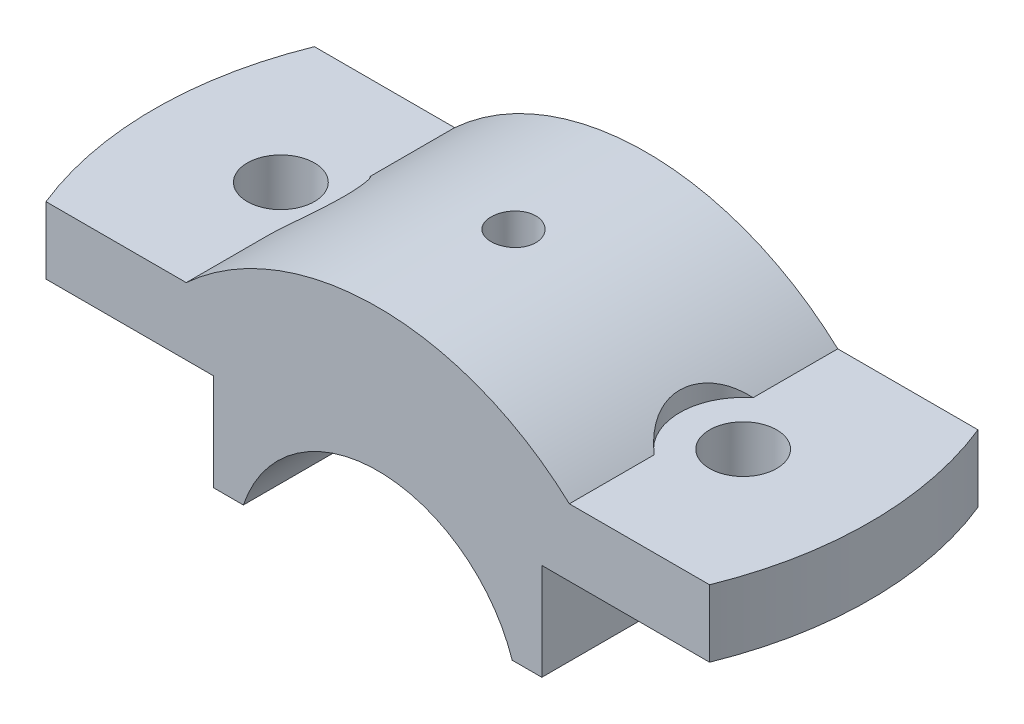
ISO-10303-21;
HEADER;
FILE_DESCRIPTION(('STEP AP214'),'2;1');
FILE_NAME('part.step','',(''),(''),'','','');
FILE_SCHEMA(('AUTOMOTIVE_DESIGN { 1 0 10303 214 1 1 1 1 }'));
ENDSEC;
DATA;
#1=APPLICATION_CONTEXT('core data for automotive mechanical design processes');
#2=APPLICATION_PROTOCOL_DEFINITION('international standard','automotive_design',2000,#1);
#3=PRODUCT_CONTEXT('',#1,'mechanical');
#4=PRODUCT('Part','Part','',(#3));
#5=PRODUCT_RELATED_PRODUCT_CATEGORY('part','',(#4));
#6=PRODUCT_DEFINITION_FORMATION('','',#4);
#7=PRODUCT_DEFINITION_CONTEXT('part definition',#1,'design');
#8=PRODUCT_DEFINITION('design','',#6,#7);
#9=PRODUCT_DEFINITION_SHAPE('','',#8);
#10=(LENGTH_UNIT() NAMED_UNIT(*) SI_UNIT(.MILLI.,.METRE.));
#11=(NAMED_UNIT(*) PLANE_ANGLE_UNIT() SI_UNIT($,.RADIAN.));
#12=(NAMED_UNIT(*) SI_UNIT($,.STERADIAN.) SOLID_ANGLE_UNIT());
#13=UNCERTAINTY_MEASURE_WITH_UNIT(LENGTH_MEASURE(1.E-05),#10,'distance_accuracy_value','');
#14=(GEOMETRIC_REPRESENTATION_CONTEXT(3) GLOBAL_UNCERTAINTY_ASSIGNED_CONTEXT((#13)) GLOBAL_UNIT_ASSIGNED_CONTEXT((#10,
#11,#12)) REPRESENTATION_CONTEXT('',''));
#15=CARTESIAN_POINT('',(0.,0.,0.));
#16=DIRECTION('',(0.,0.,1.));
#17=DIRECTION('',(1.,0.,0.));
#18=AXIS2_PLACEMENT_3D('',#15,#16,#17);
#19=CARTESIAN_POINT('',(0.,-6.00000000000001,18.));
#20=DIRECTION('',(0.,0.,-1.));
#21=DIRECTION('',(-1.,0.,0.));
#22=AXIS2_PLACEMENT_3D('',#19,#20,#21);
#23=CYLINDRICAL_SURFACE('',#22,38.);
#24=CARTESIAN_POINT('',(0.,32.,2.80128455393709));
#25=CARTESIAN_POINT('',(-0.168230277437705,31.9999984430739,2.80127719262055));
#26=CARTESIAN_POINT('',(-0.336575845655094,31.9988709200709,2.78708625310641));
#27=CARTESIAN_POINT('',(-0.668611397196741,31.9944814128081,2.73068350324043));
#28=CARTESIAN_POINT('',(-0.832295850092008,31.9912169949171,2.68843974376652));
#29=CARTESIAN_POINT('',(-1.15015205512757,31.9829226863334,2.57715861750776));
#30=CARTESIAN_POINT('',(-1.3043290493551,31.9778937789401,2.5081361714593));
#31=CARTESIAN_POINT('',(-1.59887136159142,31.9666348413683,2.34528309357255));
#32=CARTESIAN_POINT('',(-1.73923967362019,31.9604050724331,2.25145785585355));
#33=CARTESIAN_POINT('',(-2.00254103126273,31.9474277075509,2.04142864721027));
#34=CARTESIAN_POINT('',(-2.12543792166292,31.9406790810774,1.92517941033059));
#35=CARTESIAN_POINT('',(-2.34999780988339,31.9274332919605,1.67369736999665));
#36=CARTESIAN_POINT('',(-2.45165988585507,31.9209361402441,1.53846374281548));
#37=CARTESIAN_POINT('',(-2.63098484586302,31.9089176287414,1.25263521076556));
#38=CARTESIAN_POINT('',(-2.708616254697,31.903397552738,1.10202050017424));
#39=CARTESIAN_POINT('',(-2.83747510230931,31.8939696224707,0.789843402996968));
#40=CARTESIAN_POINT('',(-2.88870296451239,31.8900617423529,0.628281192019403));
#41=CARTESIAN_POINT('',(-2.96319644645853,31.8843090780474,0.299155233756735));
#42=CARTESIAN_POINT('',(-2.98652059882487,31.8824599758018,0.131604811294864));
#43=CARTESIAN_POINT('',(-3.00472536931325,31.8810204867557,-0.205042263212887));
#44=CARTESIAN_POINT('',(-2.99960647157769,31.8814300615093,-0.374138888891209));
#45=CARTESIAN_POINT('',(-2.96111886260011,31.8844577346025,-0.708677756098188));
#46=CARTESIAN_POINT('',(-2.92781369865023,31.8870708648728,-0.874127359773643));
#47=CARTESIAN_POINT('',(-2.83399765916122,31.8942034046858,-1.19708066118617));
#48=CARTESIAN_POINT('',(-2.77348654183749,31.8987228311701,-1.35458428829196));
#49=CARTESIAN_POINT('',(-2.62690490032728,31.9091644380148,-1.65737759578202));
#50=CARTESIAN_POINT('',(-2.54080579129679,31.9150881856643,-1.80265338206169));
#51=CARTESIAN_POINT('',(-2.34551283184452,31.9276694800348,-2.07671523397335));
#52=CARTESIAN_POINT('',(-2.23631856235736,31.9343270400699,-2.2055010003232));
#53=CARTESIAN_POINT('',(-1.99757813910437,31.947647885739,-2.44329660502347));
#54=CARTESIAN_POINT('',(-1.86797703439473,31.9543111370687,-2.55225128364924));
#55=CARTESIAN_POINT('',(-1.59229376436976,31.9668751419437,-2.74686564485408));
#56=CARTESIAN_POINT('',(-1.44621158946688,31.9727758950454,-2.83252531388162));
#57=CARTESIAN_POINT('',(-1.14167761997914,31.9831509930839,-2.97811437153317));
#58=CARTESIAN_POINT('',(-0.983224692335489,31.9876252071703,-3.03804139998466));
#59=CARTESIAN_POINT('',(-0.658463212690179,31.9946415451888,-3.13042586549193));
#60=CARTESIAN_POINT('',(-0.492154807064348,31.997183705107,-3.16288381418253));
#61=CARTESIAN_POINT('',(-0.156881478742686,32.0000448768352,-3.19933979046971));
#62=CARTESIAN_POINT('',(0.0120751089608364,32.0003698415183,-3.20341402516773));
#63=CARTESIAN_POINT('',(0.348269003373997,31.9987758913175,-3.18318643549693));
#64=CARTESIAN_POINT('',(0.515506324442482,31.9968569951891,-3.15888484830979));
#65=CARTESIAN_POINT('',(0.843297753735752,31.9909950041867,-3.08265859585879));
#66=CARTESIAN_POINT('',(1.00386010671882,31.987054491835,-3.03076916973323));
#67=CARTESIAN_POINT('',(1.31399900365978,31.9775920824189,-2.90087613317073));
#68=CARTESIAN_POINT('',(1.46357539119334,31.972070162843,-2.82287215098796));
#69=CARTESIAN_POINT('',(1.7478437504178,31.9600494395666,-2.6427721564642));
#70=CARTESIAN_POINT('',(1.88250358772923,31.953548595394,-2.54062556176036));
#71=CARTESIAN_POINT('',(2.13279217984117,31.9403075453845,-2.315213106574));
#72=CARTESIAN_POINT('',(2.24842063776818,31.9335673358158,-2.19194691670478));
#73=CARTESIAN_POINT('',(2.4576248497514,31.9205896766453,-1.92746409441456));
#74=CARTESIAN_POINT('',(2.55115094155127,31.9143533795852,-1.7862081151097));
#75=CARTESIAN_POINT('',(2.713155238272,31.9031055627809,-1.48995174048038));
#76=CARTESIAN_POINT('',(2.78163367119924,31.8980940318878,-1.3349514702848));
#77=CARTESIAN_POINT('',(2.89151387110068,31.8898693720601,-1.01578354585008));
#78=CARTESIAN_POINT('',(2.93294623887224,31.8866542112497,-0.851626481061855));
#79=CARTESIAN_POINT('',(2.98765790023766,31.8823793491511,-0.518659296436082));
#80=CARTESIAN_POINT('',(3.00093767292138,31.8813196111828,-0.349849255830578));
#81=CARTESIAN_POINT('',(2.99896188688675,31.8814760426206,-0.0128615871199862));
#82=CARTESIAN_POINT('',(2.98378436644711,31.8826859878913,0.15531650693869));
#83=CARTESIAN_POINT('',(2.92548733876923,31.887232237977,0.486727426956201));
#84=CARTESIAN_POINT('',(2.8823677867555,31.8905685461995,0.649960244990079));
#85=CARTESIAN_POINT('',(2.7694300101543,31.8989899804525,0.966853550807198));
#86=CARTESIAN_POINT('',(2.69961296444521,31.9040750292632,1.1205144609078));
#87=CARTESIAN_POINT('',(2.535271096382,31.9154210711218,1.41394633488595));
#88=CARTESIAN_POINT('',(2.44074672054794,31.9216820429175,1.55371754972025));
#89=CARTESIAN_POINT('',(2.22938062382269,31.9346948182221,1.81580135682108));
#90=CARTESIAN_POINT('',(2.11248130954252,31.941447859921,1.93806743909141));
#91=CARTESIAN_POINT('',(1.85978424897896,31.954672635902,2.16129011524125));
#92=CARTESIAN_POINT('',(1.72398192526551,31.9611443015481,2.26224153275267));
#93=CARTESIAN_POINT('',(1.43709756450133,31.973087613121,2.4400899796126));
#94=CARTESIAN_POINT('',(1.2859897583193,31.9785575274739,2.51694551831002));
#95=CARTESIAN_POINT('',(0.973076064569829,31.9878601967286,2.6440965558366));
#96=CARTESIAN_POINT('',(0.81128277309393,31.9916948408734,2.69442272026961));
#97=CARTESIAN_POINT('',(0.540438770546246,31.9963056825779,2.75420751965743));
#98=CARTESIAN_POINT('',(0.43313209821729,31.9976847801055,2.77183809310737));
#99=CARTESIAN_POINT('',(0.217232975456251,31.9995324404705,2.7953789734435));
#100=CARTESIAN_POINT('',(0.108640528034263,32.0000010054389,2.80128930776219));
#101=CARTESIAN_POINT('',(0.,32.,2.80128455393709));
#102=B_SPLINE_CURVE_WITH_KNOTS('',3,(#24,#25,#26,#27,#28,#29,#30,#31,#32,#33,#34,#35,#36,#37,
#38,#39,#40,#41,#42,#43,#44,#45,#46,#47,#48,#49,#50,#51,#52,#53,#54,#55,#56,#57,#58,#59,#60,#61,
#62,#63,#64,#65,#66,#67,#68,#69,#70,#71,#72,#73,#74,#75,#76,#77,#78,#79,#80,#81,#82,#83,#84,#85,
#86,#87,#88,#89,#90,#91,#92,#93,#94,#95,#96,#97,#98,#99,#100,#101),.UNSPECIFIED.,.T.,.F.,(4,2,2,
2,2,2,2,2,2,2,2,2,2,2,2,2,2,2,2,2,2,2,2,2,2,2,2,2,2,2,2,2,2,2,2,2,2,2,4),(0.,0.504294188546741,
1.00916370078726,1.51375230936014,2.01823126998903,2.5237394549149,3.02926958047039,
3.53545907123702,4.04164044416132,4.54675814609821,5.05186725021795,5.55584058602808,
6.05981840083593,6.56436134901272,7.06891345298728,7.57484819748388,8.08078323629979,
8.58676466907349,9.09273667730811,9.5973496818578,10.1019584685879,10.6059242398502,
11.1098971854695,11.6149355386039,12.1199817691652,12.6261522324058,13.1323180879118,
13.6379102536977,14.1434938154447,14.6476929456065,15.1518928837201,15.6560705605014,
16.1602391262259,16.6657233184336,17.1713301290485,17.6778028214877,18.183688785524,
18.5093549854356,18.8350204230892),.UNSPECIFIED.);
#103=CARTESIAN_POINT('',(0.,32.,2.80128455393709));
#104=VERTEX_POINT('',#103);
#105=EDGE_CURVE('E179',#104,#104,#102,.T.);
#106=ORIENTED_EDGE('',*,*,#105,.T.);
#107=EDGE_LOOP('',(#106));
#108=FACE_BOUND('',#107,.T.);
#109=DIRECTION('',(0.,0.,-1.));
#110=VECTOR('',#109,1.);
#111=CARTESIAN_POINT('',(25.6904651573303,22.,18.));
#112=LINE('',#111,#110);
#113=CARTESIAN_POINT('',(25.6904651573303,22.,18.));
#114=VERTEX_POINT('',#113);
#115=CARTESIAN_POINT('',(25.6904651573303,22.,6.63768331230678));
#116=VERTEX_POINT('',#115);
#117=EDGE_CURVE('E143',#114,#116,#112,.T.);
#118=ORIENTED_EDGE('',*,*,#117,.T.);
#119=CARTESIAN_POINT('',(25.6904651573303,22.,6.63768331230678));
#120=CARTESIAN_POINT('',(25.5360851043424,22.1416681018721,6.51420867249735));
#121=CARTESIAN_POINT('',(25.3836215551735,22.2791823336498,6.38340380017067));
#122=CARTESIAN_POINT('',(25.0841053598261,22.5451833866574,6.10685950724569));
#123=CARTESIAN_POINT('',(24.9370580895264,22.6736613482155,5.96110576476092));
#124=CARTESIAN_POINT('',(24.6491941230388,22.9215085426632,5.65349144226199));
#125=CARTESIAN_POINT('',(24.508431723833,23.0408031542341,5.49151942353938));
#126=CARTESIAN_POINT('',(24.2363075607749,23.2682904084011,5.15263687836668));
#127=CARTESIAN_POINT('',(24.1049430857226,23.3764862568107,4.9757306926307));
#128=CARTESIAN_POINT('',(23.8528205053459,23.5815743674557,4.60631493821571));
#129=CARTESIAN_POINT('',(23.7321338833277,23.6783916917415,4.41371469093333));
#130=CARTESIAN_POINT('',(23.5043908446779,23.85908164754,4.01479632179463));
#131=CARTESIAN_POINT('',(23.3973358972541,23.942952883943,3.80847672492268));
#132=CARTESIAN_POINT('',(23.1992536300817,24.0966827286364,3.38422419101503));
#133=CARTESIAN_POINT('',(23.1081729651955,24.1665880882949,3.16633319991269));
#134=CARTESIAN_POINT('',(22.9434688496595,24.2920447623401,2.72008092153073));
#135=CARTESIAN_POINT('',(22.869842066784,24.347598816803,2.49172164276592));
#136=CARTESIAN_POINT('',(22.7499342032063,24.4375648556655,2.05682098381955));
#137=CARTESIAN_POINT('',(22.7013462567531,24.4737833576563,1.8512853482319));
#138=CARTESIAN_POINT('',(22.6194172898017,24.534645499234,1.43551725204114));
#139=CARTESIAN_POINT('',(22.5860747992536,24.5592902548309,1.2252852463389));
#140=CARTESIAN_POINT('',(22.5352129551669,24.5968164834569,0.801799591498519));
#141=CARTESIAN_POINT('',(22.5176992505084,24.6096937569973,0.588544891193913));
#142=CARTESIAN_POINT('',(22.4988301660851,24.623565827118,0.160939560666227));
#143=CARTESIAN_POINT('',(22.4974739036633,24.624561272785,-0.0534110090511402));
#144=CARTESIAN_POINT('',(22.5103301119086,24.6151119876343,-0.461997479818157));
#145=CARTESIAN_POINT('',(22.5231488228924,24.6056914251708,-0.656303160135783));
#146=CARTESIAN_POINT('',(22.5619809221014,24.5770763766543,-1.04286259298842));
#147=CARTESIAN_POINT('',(22.5879939672906,24.5578821447042,-1.23511639873689));
#148=CARTESIAN_POINT('',(22.6528192304938,24.5098574663833,-1.6161390672981));
#149=CARTESIAN_POINT('',(22.6916259266854,24.4810311771979,-1.80490939654949));
#150=CARTESIAN_POINT('',(22.7814851533844,24.4139289484325,-2.17779604427595));
#151=CARTESIAN_POINT('',(22.8325379785098,24.3756527815061,-2.36191225066403));
#152=CARTESIAN_POINT('',(22.9463727274415,24.2897519777021,-2.72495933677604));
#153=CARTESIAN_POINT('',(23.0091940590921,24.2420959034168,-2.90387039063448));
#154=CARTESIAN_POINT('',(23.1456283742011,24.1378044455698,-3.25489148863351));
#155=CARTESIAN_POINT('',(23.2192449894416,24.0811660396201,-3.4269992191435));
#156=CARTESIAN_POINT('',(23.3763137314078,23.9592695660632,-3.76349373210637));
#157=CARTESIAN_POINT('',(23.4597660818508,23.8940113023904,-3.92788033882067));
#158=CARTESIAN_POINT('',(23.635527045378,23.7552415450916,-4.24828704232644));
#159=CARTESIAN_POINT('',(23.7278387953854,23.6817271265587,-4.40430414494656));
#160=CARTESIAN_POINT('',(23.9282386479047,23.5204551498757,-4.71995510834892));
#161=CARTESIAN_POINT('',(24.0370002176616,23.432022004933,-4.87881602386907));
#162=CARTESIAN_POINT('',(24.2623844714665,23.2465042091277,-5.18563329619881));
#163=CARTESIAN_POINT('',(24.379010630913,23.149415727248,-5.33358477081363));
#164=CARTESIAN_POINT('',(24.6187042069683,22.9472618083659,-5.61815393006347));
#165=CARTESIAN_POINT('',(24.7417672458198,22.8422017715012,-5.75477915839728));
#166=CARTESIAN_POINT('',(24.9931857635632,22.6246099475779,-6.01673825944901));
#167=CARTESIAN_POINT('',(25.121541230047,22.5120781780363,-6.14207215863706));
#168=CARTESIAN_POINT('',(25.3239635142993,22.3320696328102,-6.32788833390874));
#169=CARTESIAN_POINT('',(25.3966039536004,22.2669811541268,-6.39227987552885));
#170=CARTESIAN_POINT('',(25.5428336292653,22.1349133065772,-6.51755974656749));
#171=CARTESIAN_POINT('',(25.6164208573994,22.0679376662269,-6.57845434819234));
#172=CARTESIAN_POINT('',(25.6904651573302,22.0000000000002,-6.63768331230704));
#173=B_SPLINE_CURVE_WITH_KNOTS('',3,(#119,#120,#121,#122,#123,#124,#125,#126,#127,#128,#129,
#130,#131,#132,#133,#134,#135,#136,#137,#138,#139,#140,#141,#142,#143,#144,#145,#146,#147,#148,
#149,#150,#151,#152,#153,#154,#155,#156,#157,#158,#159,#160,#161,#162,#163,#164,#165,#166,#167,
#168,#169,#170,#171,#172),.UNSPECIFIED.,.F.,.F.,(4,2,2,2,2,2,2,2,2,2,2,2,2,2,2,2,2,2,2,2,2,2,2,
2,2,2,4),(0.,0.729592400834068,1.45989044138351,2.19560470883998,2.93110586753775,
3.67120763552797,4.41138910352642,5.14904966030396,5.88656927223679,6.52855006409983,
7.17046893961488,7.81261680885219,8.45472959834444,9.03890309081731,9.62306139629813,
10.2069679046447,10.7908884620571,11.3768004587137,11.9629100238154,12.549032922753,
13.1353641263273,13.7703169673958,14.4055522594533,15.040361004022,15.6751682603777,
16.0257258218313,16.3756336015192),.UNSPECIFIED.);
#174=CARTESIAN_POINT('',(25.6904651573303,22.,-6.63768331230678));
#175=VERTEX_POINT('',#174);
#176=EDGE_CURVE('E135',#116,#175,#173,.T.);
#177=ORIENTED_EDGE('',*,*,#176,.T.);
#178=CARTESIAN_POINT('',(25.6904651573303,22.,-18.));
#179=VERTEX_POINT('',#178);
#180=EDGE_CURVE('E140',#175,#179,#112,.T.);
#181=ORIENTED_EDGE('',*,*,#180,.T.);
#182=CARTESIAN_POINT('',(0.,-6.00000000000001,-18.));
#183=DIRECTION('',(0.,0.,1.));
#184=DIRECTION('',(1.,0.,0.));
#185=AXIS2_PLACEMENT_3D('',#182,#183,#184);
#186=CIRCLE('',#185,38.);
#187=CARTESIAN_POINT('',(-25.6904651573303,22.,-18.));
#188=VERTEX_POINT('',#187);
#189=EDGE_CURVE('E271',#179,#188,#186,.T.);
#190=ORIENTED_EDGE('',*,*,#189,.T.);
#191=DIRECTION('',(0.,0.,-1.));
#192=VECTOR('',#191,1.);
#193=CARTESIAN_POINT('',(-25.6904651573303,22.,18.));
#194=LINE('',#193,#192);
#195=CARTESIAN_POINT('',(-25.6904651573303,22.,-6.63768331230678));
#196=VERTEX_POINT('',#195);
#197=EDGE_CURVE('E176',#196,#188,#194,.T.);
#198=ORIENTED_EDGE('',*,*,#197,.F.);
#199=CARTESIAN_POINT('',(-25.6904651573303,22.,6.63768331230678));
#200=CARTESIAN_POINT('',(-25.5360851043424,22.1416681018721,6.51420867249735));
#201=CARTESIAN_POINT('',(-25.3836215551735,22.2791823336498,6.38340380017067));
#202=CARTESIAN_POINT('',(-25.0841053598261,22.5451833866574,6.10685950724569));
#203=CARTESIAN_POINT('',(-24.9370580895264,22.6736613482155,5.96110576476092));
#204=CARTESIAN_POINT('',(-24.6491941230388,22.9215085426632,5.65349144226199));
#205=CARTESIAN_POINT('',(-24.508431723833,23.0408031542341,5.49151942353938));
#206=CARTESIAN_POINT('',(-24.2363075607749,23.268290408401,5.15263687836668));
#207=CARTESIAN_POINT('',(-24.1049430857226,23.3764862568107,4.9757306926307));
#208=CARTESIAN_POINT('',(-23.8528205053459,23.5815743674557,4.60631493821571));
#209=CARTESIAN_POINT('',(-23.7321338833277,23.6783916917415,4.41371469093333));
#210=CARTESIAN_POINT('',(-23.5043908446779,23.85908164754,4.01479632179464));
#211=CARTESIAN_POINT('',(-23.3973358972541,23.9429528839429,3.80847672492269));
#212=CARTESIAN_POINT('',(-23.1992536300817,24.0966827286364,3.38422419101503));
#213=CARTESIAN_POINT('',(-23.1081729651955,24.1665880882949,3.16633319991269));
#214=CARTESIAN_POINT('',(-22.9434688496595,24.2920447623401,2.72008092153074));
#215=CARTESIAN_POINT('',(-22.869842066784,24.347598816803,2.49172164276592));
#216=CARTESIAN_POINT('',(-22.7499342032063,24.4375648556655,2.05682098381955));
#217=CARTESIAN_POINT('',(-22.7013462567531,24.4737833576563,1.85128534823191));
#218=CARTESIAN_POINT('',(-22.6194172898017,24.534645499234,1.43551725204114));
#219=CARTESIAN_POINT('',(-22.5860747992536,24.5592902548309,1.2252852463389));
#220=CARTESIAN_POINT('',(-22.5352129551669,24.5968164834569,0.801799591498521));
#221=CARTESIAN_POINT('',(-22.5176992505084,24.6096937569973,0.588544891193916));
#222=CARTESIAN_POINT('',(-22.4988301660851,24.623565827118,0.160939560666229));
#223=CARTESIAN_POINT('',(-22.4974739036633,24.624561272785,-0.0534110090511381));
#224=CARTESIAN_POINT('',(-22.5103301119086,24.6151119876343,-0.461997479818154));
#225=CARTESIAN_POINT('',(-22.5231488228924,24.6056914251708,-0.65630316013578));
#226=CARTESIAN_POINT('',(-22.5619809221014,24.5770763766543,-1.04286259298842));
#227=CARTESIAN_POINT('',(-22.5879939672906,24.5578821447042,-1.23511639873689));
#228=CARTESIAN_POINT('',(-22.6528192304938,24.5098574663832,-1.6161390672981));
#229=CARTESIAN_POINT('',(-22.6916259266854,24.4810311771979,-1.80490939654949));
#230=CARTESIAN_POINT('',(-22.7814851533844,24.4139289484325,-2.17779604427595));
#231=CARTESIAN_POINT('',(-22.8325379785098,24.3756527815061,-2.36191225066403));
#232=CARTESIAN_POINT('',(-22.9463727274415,24.2897519777021,-2.72495933677603));
#233=CARTESIAN_POINT('',(-23.0091940590921,24.2420959034168,-2.90387039063447));
#234=CARTESIAN_POINT('',(-23.1456283742011,24.1378044455698,-3.2548914886335));
#235=CARTESIAN_POINT('',(-23.2192449894416,24.0811660396201,-3.4269992191435));
#236=CARTESIAN_POINT('',(-23.3763137314078,23.9592695660632,-3.76349373210637));
#237=CARTESIAN_POINT('',(-23.4597660818508,23.8940113023904,-3.92788033882066));
#238=CARTESIAN_POINT('',(-23.635527045378,23.7552415450916,-4.24828704232643));
#239=CARTESIAN_POINT('',(-23.7278387953854,23.6817271265587,-4.40430414494656));
#240=CARTESIAN_POINT('',(-23.9282386479047,23.5204551498757,-4.71995510834892));
#241=CARTESIAN_POINT('',(-24.0370002176616,23.432022004933,-4.87881602386906));
#242=CARTESIAN_POINT('',(-24.2623844714665,23.2465042091277,-5.1856332961988));
#243=CARTESIAN_POINT('',(-24.379010630913,23.149415727248,-5.33358477081363));
#244=CARTESIAN_POINT('',(-24.6187042069683,22.9472618083659,-5.61815393006347));
#245=CARTESIAN_POINT('',(-24.7417672458198,22.8422017715012,-5.75477915839727));
#246=CARTESIAN_POINT('',(-24.9931857635632,22.6246099475779,-6.016738259449));
#247=CARTESIAN_POINT('',(-25.121541230047,22.5120781780363,-6.14207215863705));
#248=CARTESIAN_POINT('',(-25.3239635142993,22.3320696328102,-6.32788833390874));
#249=CARTESIAN_POINT('',(-25.3966039536004,22.2669811541268,-6.39227987552885));
#250=CARTESIAN_POINT('',(-25.5428336292653,22.1349133065772,-6.51755974656749));
#251=CARTESIAN_POINT('',(-25.6164208573994,22.0679376662269,-6.57845434819234));
#252=CARTESIAN_POINT('',(-25.6904651573302,22.0000000000002,-6.63768331230705));
#253=B_SPLINE_CURVE_WITH_KNOTS('',3,(#199,#200,#201,#202,#203,#204,#205,#206,#207,#208,#209,
#210,#211,#212,#213,#214,#215,#216,#217,#218,#219,#220,#221,#222,#223,#224,#225,#226,#227,#228,
#229,#230,#231,#232,#233,#234,#235,#236,#237,#238,#239,#240,#241,#242,#243,#244,#245,#246,#247,
#248,#249,#250,#251,#252),.UNSPECIFIED.,.F.,.F.,(4,2,2,2,2,2,2,2,2,2,2,2,2,2,2,2,2,2,2,2,2,2,2,
2,2,2,4),(0.,0.729592400834068,1.45989044138351,2.19560470883998,2.93110586753775,
3.67120763552797,4.41138910352642,5.14904966030396,5.88656927223678,6.52855006409983,
7.17046893961488,7.81261680885219,8.45472959834444,9.03890309081731,9.62306139629812,
10.2069679046447,10.7908884620571,11.3768004587137,11.9629100238154,12.549032922753,
13.1353641263273,13.7703169673958,14.4055522594533,15.040361004022,15.6751682603777,
16.0257258218313,16.3756336015193),.UNSPECIFIED.);
#254=CARTESIAN_POINT('',(-25.6904651573303,22.,6.63768331230678));
#255=VERTEX_POINT('',#254);
#256=EDGE_CURVE('E320',#255,#196,#253,.T.);
#257=ORIENTED_EDGE('',*,*,#256,.F.);
#258=CARTESIAN_POINT('',(-25.6904651573303,22.,18.));
#259=VERTEX_POINT('',#258);
#260=EDGE_CURVE('E177',#259,#255,#194,.T.);
#261=ORIENTED_EDGE('',*,*,#260,.F.);
#262=CARTESIAN_POINT('',(0.,-6.00000000000001,18.));
#263=DIRECTION('',(0.,0.,1.));
#264=DIRECTION('',(1.,0.,0.));
#265=AXIS2_PLACEMENT_3D('',#262,#263,#264);
#266=CIRCLE('',#265,38.);
#267=EDGE_CURVE('E291',#114,#259,#266,.T.);
#268=ORIENTED_EDGE('',*,*,#267,.F.);
#269=EDGE_LOOP('',(#118,#177,#181,#190,#198,#257,#261,#268));
#270=FACE_BOUND('',#269,.T.);
#271=ADVANCED_FACE('F33',(#108,#270),#23,.T.);
#272=CARTESIAN_POINT('',(-50.,22.,18.));
#273=DIRECTION('',(0.,-1.,0.));
#274=DIRECTION('',(1.,0.,0.));
#275=AXIS2_PLACEMENT_3D('',#272,#273,#274);
#276=PLANE('',#275);
#277=CARTESIAN_POINT('',(-31.,22.,0.));
#278=DIRECTION('',(0.,1.,0.));
#279=DIRECTION('',(0.,0.,1.));
#280=AXIS2_PLACEMENT_3D('',#277,#278,#279);
#281=CIRCLE('',#280,4.49999999999999);
#282=CARTESIAN_POINT('',(-31.,22.,4.49999999999999));
#283=VERTEX_POINT('',#282);
#284=EDGE_CURVE('E261',#283,#283,#281,.T.);
#285=ORIENTED_EDGE('',*,*,#284,.F.);
#286=EDGE_LOOP('',(#285));
#287=FACE_BOUND('',#286,.T.);
#288=DIRECTION('',(-1.,0.,0.));
#289=VECTOR('',#288,1.);
#290=CARTESIAN_POINT('',(-50.,22.,-18.));
#291=LINE('',#290,#289);
#292=CARTESIAN_POINT('',(-44.497190922574,22.,-18.));
#293=VERTEX_POINT('',#292);
#294=EDGE_CURVE('E265',#188,#293,#291,.T.);
#295=ORIENTED_EDGE('',*,*,#294,.T.);
#296=CARTESIAN_POINT('',(0.,22.,0.));
#297=DIRECTION('',(0.,-1.,0.));
#298=DIRECTION('',(1.,0.,0.));
#299=AXIS2_PLACEMENT_3D('',#296,#297,#298);
#300=CIRCLE('',#299,48.);
#301=CARTESIAN_POINT('',(-44.497190922574,22.,18.));
#302=VERTEX_POINT('',#301);
#303=EDGE_CURVE('E266',#293,#302,#300,.F.);
#304=ORIENTED_EDGE('',*,*,#303,.T.);
#305=DIRECTION('',(-1.,0.,0.));
#306=VECTOR('',#305,1.);
#307=CARTESIAN_POINT('',(-50.,22.,18.));
#308=LINE('',#307,#306);
#309=EDGE_CURVE('E293',#259,#302,#308,.T.);
#310=ORIENTED_EDGE('',*,*,#309,.F.);
#311=ORIENTED_EDGE('',*,*,#260,.T.);
#312=CARTESIAN_POINT('',(-31.,22.,0.));
#313=DIRECTION('',(0.,1.,0.));
#314=DIRECTION('',(-1.,0.,0.));
#315=AXIS2_PLACEMENT_3D('',#312,#313,#314);
#316=CIRCLE('',#315,8.5);
#317=EDGE_CURVE('E56',#255,#196,#316,.T.);
#318=ORIENTED_EDGE('',*,*,#317,.T.);
#319=ORIENTED_EDGE('',*,*,#197,.T.);
#320=EDGE_LOOP('',(#295,#304,#310,#311,#318,#319));
#321=FACE_BOUND('',#320,.T.);
#322=ADVANCED_FACE('F251',(#287,#321),#276,.F.);
#323=CARTESIAN_POINT('',(-22.,13.,18.));
#324=DIRECTION('',(0.,1.,0.));
#325=DIRECTION('',(-1.,0.,0.));
#326=AXIS2_PLACEMENT_3D('',#323,#324,#325);
#327=PLANE('',#326);
#328=CARTESIAN_POINT('',(-31.,13.,0.));
#329=DIRECTION('',(0.,1.,0.));
#330=DIRECTION('',(-1.,0.,0.));
#331=AXIS2_PLACEMENT_3D('',#328,#329,#330);
#332=CIRCLE('',#331,4.49999999999999);
#333=CARTESIAN_POINT('',(-35.5,13.,0.));
#334=VERTEX_POINT('',#333);
#335=EDGE_CURVE('E275',#334,#334,#332,.T.);
#336=ORIENTED_EDGE('',*,*,#335,.T.);
#337=EDGE_LOOP('',(#336));
#338=FACE_BOUND('',#337,.T.);
#339=DIRECTION('',(1.,0.,0.));
#340=VECTOR('',#339,1.);
#341=CARTESIAN_POINT('',(-22.,13.,18.));
#342=LINE('',#341,#340);
#343=CARTESIAN_POINT('',(-44.497190922574,13.,18.));
#344=VERTEX_POINT('',#343);
#345=CARTESIAN_POINT('',(-22.,13.,18.));
#346=VERTEX_POINT('',#345);
#347=EDGE_CURVE('E296',#344,#346,#342,.T.);
#348=ORIENTED_EDGE('',*,*,#347,.F.);
#349=CARTESIAN_POINT('',(0.,13.,0.));
#350=DIRECTION('',(0.,1.,0.));
#351=DIRECTION('',(1.,0.,0.));
#352=AXIS2_PLACEMENT_3D('',#349,#350,#351);
#353=CIRCLE('',#352,48.);
#354=CARTESIAN_POINT('',(-44.497190922574,13.,-18.));
#355=VERTEX_POINT('',#354);
#356=EDGE_CURVE('E332',#355,#344,#353,.T.);
#357=ORIENTED_EDGE('',*,*,#356,.F.);
#358=DIRECTION('',(1.,0.,0.));
#359=VECTOR('',#358,1.);
#360=CARTESIAN_POINT('',(-22.,13.,-18.));
#361=LINE('',#360,#359);
#362=CARTESIAN_POINT('',(-22.,13.,-18.));
#363=VERTEX_POINT('',#362);
#364=EDGE_CURVE('E270',#355,#363,#361,.T.);
#365=ORIENTED_EDGE('',*,*,#364,.T.);
#366=DIRECTION('',(0.,0.,-1.));
#367=VECTOR('',#366,1.);
#368=CARTESIAN_POINT('',(-22.,13.,18.));
#369=LINE('',#368,#367);
#370=EDGE_CURVE('E173',#346,#363,#369,.T.);
#371=ORIENTED_EDGE('',*,*,#370,.F.);
#372=EDGE_LOOP('',(#348,#357,#365,#371));
#373=FACE_BOUND('',#372,.T.);
#374=ADVANCED_FACE('F248',(#338,#373),#327,.F.);
#375=CARTESIAN_POINT('',(-22.,0.,18.));
#376=DIRECTION('',(1.,0.,0.));
#377=DIRECTION('',(0.,0.,-1.));
#378=AXIS2_PLACEMENT_3D('',#375,#376,#377);
#379=PLANE('',#378);
#380=DIRECTION('',(0.,-1.,0.));
#381=VECTOR('',#380,1.);
#382=CARTESIAN_POINT('',(-22.,0.,-18.));
#383=LINE('',#382,#381);
#384=CARTESIAN_POINT('',(-22.,0.,-18.));
#385=VERTEX_POINT('',#384);
#386=EDGE_CURVE('E273',#363,#385,#383,.T.);
#387=ORIENTED_EDGE('',*,*,#386,.T.);
#388=DIRECTION('',(0.,0.,-1.));
#389=VECTOR('',#388,1.);
#390=CARTESIAN_POINT('',(-22.,0.,18.));
#391=LINE('',#390,#389);
#392=CARTESIAN_POINT('',(-22.,0.,18.));
#393=VERTEX_POINT('',#392);
#394=EDGE_CURVE('E170',#393,#385,#391,.T.);
#395=ORIENTED_EDGE('',*,*,#394,.F.);
#396=DIRECTION('',(0.,-1.,0.));
#397=VECTOR('',#396,1.);
#398=CARTESIAN_POINT('',(-22.,0.,18.));
#399=LINE('',#398,#397);
#400=EDGE_CURVE('E302',#346,#393,#399,.T.);
#401=ORIENTED_EDGE('',*,*,#400,.F.);
#402=ORIENTED_EDGE('',*,*,#370,.T.);
#403=EDGE_LOOP('',(#387,#395,#401,#402));
#404=FACE_BOUND('',#403,.T.);
#405=ADVANCED_FACE('F244',(#404),#379,.F.);
#406=CARTESIAN_POINT('',(-18.0277563773199,0.,18.));
#407=DIRECTION('',(0.,1.,0.));
#408=DIRECTION('',(-1.,0.,0.));
#409=AXIS2_PLACEMENT_3D('',#406,#407,#408);
#410=PLANE('',#409);
#411=DIRECTION('',(1.,0.,0.));
#412=VECTOR('',#411,1.);
#413=CARTESIAN_POINT('',(-18.0277563773199,0.,-18.));
#414=LINE('',#413,#412);
#415=CARTESIAN_POINT('',(-18.0277563773199,0.,-18.));
#416=VERTEX_POINT('',#415);
#417=EDGE_CURVE('E279',#385,#416,#414,.T.);
#418=ORIENTED_EDGE('',*,*,#417,.T.);
#419=DIRECTION('',(0.,0.,-1.));
#420=VECTOR('',#419,1.);
#421=CARTESIAN_POINT('',(-18.0277563773199,0.,18.));
#422=LINE('',#421,#420);
#423=CARTESIAN_POINT('',(-18.0277563773199,0.,18.));
#424=VERTEX_POINT('',#423);
#425=EDGE_CURVE('E167',#424,#416,#422,.T.);
#426=ORIENTED_EDGE('',*,*,#425,.F.);
#427=DIRECTION('',(1.,0.,0.));
#428=VECTOR('',#427,1.);
#429=CARTESIAN_POINT('',(-18.0277563773199,0.,18.));
#430=LINE('',#429,#428);
#431=EDGE_CURVE('E304',#393,#424,#430,.T.);
#432=ORIENTED_EDGE('',*,*,#431,.F.);
#433=ORIENTED_EDGE('',*,*,#394,.T.);
#434=EDGE_LOOP('',(#418,#426,#432,#433));
#435=FACE_BOUND('',#434,.T.);
#436=ADVANCED_FACE('F240',(#435),#410,.F.);
#437=CARTESIAN_POINT('',(0.,-6.00000000000001,18.));
#438=DIRECTION('',(0.,0.,-1.));
#439=DIRECTION('',(-1.,0.,0.));
#440=AXIS2_PLACEMENT_3D('',#437,#438,#439);
#441=CYLINDRICAL_SURFACE('',#440,19.);
#442=CARTESIAN_POINT('',(0.,13.,2.30128455393709));
#443=CARTESIAN_POINT('',(0.139778315489381,12.999997967774,2.30127865488316));
#444=CARTESIAN_POINT('',(0.279642447495433,12.9984412683557,2.2895222286956));
#445=CARTESIAN_POINT('',(0.555474474016764,12.9923810422329,2.24281155797344));
#446=CARTESIAN_POINT('',(0.691438217949603,12.9878744896332,2.20783349266261));
#447=CARTESIAN_POINT('',(0.955436642925263,12.9764219373405,2.1157316129981));
#448=CARTESIAN_POINT('',(1.08347675216936,12.9694776299244,2.05862315859642));
#449=CARTESIAN_POINT('',(1.32813277832855,12.9539206812215,1.92391620848124));
#450=CARTESIAN_POINT('',(1.44475055826477,12.9453083126858,1.84632106187285));
#451=CARTESIAN_POINT('',(1.66398308687909,12.9273173646443,1.67233993506095));
#452=CARTESIAN_POINT('',(1.76651843289981,12.9179348817316,1.57585429346414));
#453=CARTESIAN_POINT('',(1.95399133146887,12.8994924119599,1.36704520126718));
#454=CARTESIAN_POINT('',(2.0389279601093,12.890432442053,1.25472091968069));
#455=CARTESIAN_POINT('',(2.18909162338547,12.8736225658863,1.01690245243126));
#456=CARTESIAN_POINT('',(2.254243636291,12.8658776941045,0.891360509883617));
#457=CARTESIAN_POINT('',(2.36250946256607,12.8526269269546,0.630997863605943));
#458=CARTESIAN_POINT('',(2.40562420041089,12.8471209376663,0.496177549377758));
#459=CARTESIAN_POINT('',(2.46834893112872,12.8390089488849,0.221912325114677));
#460=CARTESIAN_POINT('',(2.48809350572304,12.8363863510935,0.0824986936435946));
#461=CARTESIAN_POINT('',(2.50393399543624,12.8342874081065,-0.197686024609167));
#462=CARTESIAN_POINT('',(2.50003096100306,12.8348109231579,-0.33845705081682));
#463=CARTESIAN_POINT('',(2.46879737750757,12.8389298660036,-0.61641954400739));
#464=CARTESIAN_POINT('',(2.44161547626707,12.8425058020086,-0.753628043999711));
#465=CARTESIAN_POINT('',(2.36482786882149,12.852296258763,-1.02151920881637));
#466=CARTESIAN_POINT('',(2.31522166359116,12.8585108382319,-1.15220172834119));
#467=CARTESIAN_POINT('',(2.19483509097755,12.8729003199956,-1.40379078121893));
#468=CARTESIAN_POINT('',(2.12399053069557,12.8810811502029,-1.52466624507351));
#469=CARTESIAN_POINT('',(1.96318413435717,12.8984768576706,-1.75286937736369));
#470=CARTESIAN_POINT('',(1.87322133002782,12.9076917872934,-1.86019635917653));
#471=CARTESIAN_POINT('',(1.67591027855668,12.9262039286228,-2.05911839698431));
#472=CARTESIAN_POINT('',(1.5684339827901,12.9355012293484,-2.15058648094408));
#473=CARTESIAN_POINT('',(1.33958658891131,12.9530645440151,-2.31420428640345));
#474=CARTESIAN_POINT('',(1.21821545257772,12.9613305551191,-2.3863539547609));
#475=CARTESIAN_POINT('',(0.964922757293814,12.9759058695861,-2.50928853293962));
#476=CARTESIAN_POINT('',(0.832997072631038,12.9822144030351,-2.56006503907416));
#477=CARTESIAN_POINT('',(0.562390331231886,12.9921571388021,-2.63870878950058));
#478=CARTESIAN_POINT('',(0.423709625549348,12.9957914799383,-2.66657722296671));
#479=CARTESIAN_POINT('',(0.144626841595052,12.9999582136113,-2.69844813073062));
#480=CARTESIAN_POINT('',(0.00424505397900236,13.0005133278906,-2.70262542805527));
#481=CARTESIAN_POINT('',(-0.275216665266615,12.9985205333266,-2.6874575034092));
#482=CARTESIAN_POINT('',(-0.414296627611643,12.9959726978817,-2.66811283783609));
#483=CARTESIAN_POINT('',(-0.686687509149988,12.9880744020358,-2.60659538703066));
#484=CARTESIAN_POINT('',(-0.820017679004482,12.9827342327916,-2.56450640712513));
#485=CARTESIAN_POINT('',(-1.07772769061604,12.9698488481686,-2.45878251483957));
#486=CARTESIAN_POINT('',(-1.20210719868892,12.9623035506347,-2.39514679969283));
#487=CARTESIAN_POINT('',(-1.43916303555311,12.9457917882835,-2.24771601124639));
#488=CARTESIAN_POINT('',(-1.55176881159961,12.9368174879556,-2.16380838817655));
#489=CARTESIAN_POINT('',(-1.76136182953435,12.9184749473973,-1.97837421199655));
#490=CARTESIAN_POINT('',(-1.85834838132062,12.9091066897838,-1.87684688080887));
#491=CARTESIAN_POINT('',(-2.03457405133125,12.8909615049602,-1.65828312023872));
#492=CARTESIAN_POINT('',(-2.11369695379329,12.882188695812,-1.54115259507593));
#493=CARTESIAN_POINT('',(-2.25114524350548,12.8662967388838,-1.29516176961281));
#494=CARTESIAN_POINT('',(-2.30947108507654,12.8591775549807,-1.16630172562616));
#495=CARTESIAN_POINT('',(-2.40348340588749,12.8474274353121,-0.900877690861148));
#496=CARTESIAN_POINT('',(-2.43923433050313,12.8427894223097,-0.764336853204343));
#497=CARTESIAN_POINT('',(-2.48728896692711,12.8365068588229,-0.48712460050093));
#498=CARTESIAN_POINT('',(-2.49959389747028,12.834862152745,-0.346453400538667));
#499=CARTESIAN_POINT('',(-2.50038325713136,12.8347572836292,-0.0661302281595741));
#500=CARTESIAN_POINT('',(-2.48905029281034,12.8362727080523,0.0735212558801144));
#501=CARTESIAN_POINT('',(-2.44327339157393,12.8422647251657,0.348915568437359));
#502=CARTESIAN_POINT('',(-2.40882946081797,12.8467413170668,0.484658397996623));
#503=CARTESIAN_POINT('',(-2.31786734754336,12.8581434764998,0.748351535032737));
#504=CARTESIAN_POINT('',(-2.26135895042261,12.8650679582854,0.876305267868893));
#505=CARTESIAN_POINT('',(-2.12788991460023,12.8805873470396,1.12094427817589));
#506=CARTESIAN_POINT('',(-2.05092891076783,12.8891822838294,1.23762935442199));
#507=CARTESIAN_POINT('',(-1.87806508524071,12.9071536004537,1.4573509883669));
#508=CARTESIAN_POINT('',(-1.78202633147283,12.916535291463,1.56028017721261));
#509=CARTESIAN_POINT('',(-1.57401834863999,12.9349767535594,1.74862999768158));
#510=CARTESIAN_POINT('',(-1.46204538383397,12.9440364485309,1.83404651200187));
#511=CARTESIAN_POINT('',(-1.22480279057949,12.9608556769231,1.9852567930052));
#512=CARTESIAN_POINT('',(-1.09947920166897,12.9686095798624,2.05096648976147));
#513=CARTESIAN_POINT('',(-0.83954097304368,12.9818871351466,2.16031185498828));
#514=CARTESIAN_POINT('',(-0.704936491101718,12.9874131818538,2.20397123460526));
#515=CARTESIAN_POINT('',(-0.474714442967835,12.9942975150946,2.25765908016176));
#516=CARTESIAN_POINT('',(-0.380541684686488,12.9964253917168,2.27399476090955));
#517=CARTESIAN_POINT('',(-0.19092595858504,12.9992773223142,2.29580946649514));
#518=CARTESIAN_POINT('',(-0.0954830015668618,13.0000013882199,2.30128858359915));
#519=CARTESIAN_POINT('',(0.,13.,2.30128455393709));
#520=B_SPLINE_CURVE_WITH_KNOTS('',3,(#442,#443,#444,#445,#446,#447,#448,#449,#450,#451,#452,
#453,#454,#455,#456,#457,#458,#459,#460,#461,#462,#463,#464,#465,#466,#467,#468,#469,#470,#471,
#472,#473,#474,#475,#476,#477,#478,#479,#480,#481,#482,#483,#484,#485,#486,#487,#488,#489,#490,
#491,#492,#493,#494,#495,#496,#497,#498,#499,#500,#501,#502,#503,#504,#505,#506,#507,#508,#509,
#510,#511,#512,#513,#514,#515,#516,#517,#518,#519),.UNSPECIFIED.,.T.,.F.,(4,2,2,2,2,2,2,2,2,2,2,
2,2,2,2,2,2,2,2,2,2,2,2,2,2,2,2,2,2,2,2,2,2,2,2,2,2,2,4),(0.,0.418986144750716,
0.838402751295032,1.25752877489171,1.67658632335898,2.09791737096997,2.5192705322666,
2.94220203521432,3.36511579450622,3.78558208482052,4.20602969778295,4.62381238038423,
5.04160436068184,5.46067207111285,5.87976101093415,6.30206422391833,6.72436859858556,
7.14683886382432,7.56928719694783,7.98861407741508,8.40793103915518,8.82571338706287,
9.24351130200043,9.66368440831749,10.0838760739927,10.5067272952287,10.9295692785285,
11.3511986374782,11.7728060793191,12.1911686022117,12.6095310136043,13.027708095279,
13.4458926429742,13.8671712161902,14.2885487204711,14.7116990687392,15.1343934209874,
15.4206065905888,15.7068173277526),.UNSPECIFIED.);
#521=CARTESIAN_POINT('',(0.,13.,2.30128455393709));
#522=VERTEX_POINT('',#521);
#523=EDGE_CURVE('E185',#522,#522,#520,.T.);
#524=ORIENTED_EDGE('',*,*,#523,.T.);
#525=EDGE_LOOP('',(#524));
#526=FACE_BOUND('',#525,.T.);
#527=CARTESIAN_POINT('',(0.,-6.00000000000001,-18.));
#528=DIRECTION('',(0.,0.,-1.));
#529=DIRECTION('',(1.,0.,0.));
#530=AXIS2_PLACEMENT_3D('',#527,#528,#529);
#531=CIRCLE('',#530,19.);
#532=CARTESIAN_POINT('',(18.0277563773199,0.,-18.));
#533=VERTEX_POINT('',#532);
#534=EDGE_CURVE('E281',#416,#533,#531,.T.);
#535=ORIENTED_EDGE('',*,*,#534,.T.);
#536=DIRECTION('',(0.,0.,-1.));
#537=VECTOR('',#536,1.);
#538=CARTESIAN_POINT('',(18.0277563773199,0.,18.));
#539=LINE('',#538,#537);
#540=CARTESIAN_POINT('',(18.0277563773199,0.,18.));
#541=VERTEX_POINT('',#540);
#542=EDGE_CURVE('E164',#541,#533,#539,.T.);
#543=ORIENTED_EDGE('',*,*,#542,.F.);
#544=CARTESIAN_POINT('',(0.,-6.00000000000001,18.));
#545=DIRECTION('',(0.,0.,-1.));
#546=DIRECTION('',(1.,0.,0.));
#547=AXIS2_PLACEMENT_3D('',#544,#545,#546);
#548=CIRCLE('',#547,19.);
#549=EDGE_CURVE('E306',#424,#541,#548,.T.);
#550=ORIENTED_EDGE('',*,*,#549,.F.);
#551=ORIENTED_EDGE('',*,*,#425,.T.);
#552=EDGE_LOOP('',(#535,#543,#550,#551));
#553=FACE_BOUND('',#552,.T.);
#554=ADVANCED_FACE('F235',(#526,#553),#441,.F.);
#555=CARTESIAN_POINT('',(18.0277563773199,0.,18.));
#556=DIRECTION('',(0.,1.,0.));
#557=DIRECTION('',(-1.,0.,0.));
#558=AXIS2_PLACEMENT_3D('',#555,#556,#557);
#559=PLANE('',#558);
#560=DIRECTION('',(1.,0.,0.));
#561=VECTOR('',#560,1.);
#562=CARTESIAN_POINT('',(18.0277563773199,0.,-18.));
#563=LINE('',#562,#561);
#564=CARTESIAN_POINT('',(22.,0.,-18.));
#565=VERTEX_POINT('',#564);
#566=EDGE_CURVE('E283',#533,#565,#563,.T.);
#567=ORIENTED_EDGE('',*,*,#566,.T.);
#568=DIRECTION('',(0.,0.,-1.));
#569=VECTOR('',#568,1.);
#570=CARTESIAN_POINT('',(22.,0.,18.));
#571=LINE('',#570,#569);
#572=CARTESIAN_POINT('',(22.,0.,18.));
#573=VERTEX_POINT('',#572);
#574=EDGE_CURVE('E161',#573,#565,#571,.T.);
#575=ORIENTED_EDGE('',*,*,#574,.F.);
#576=DIRECTION('',(1.,0.,0.));
#577=VECTOR('',#576,1.);
#578=CARTESIAN_POINT('',(18.0277563773199,0.,18.));
#579=LINE('',#578,#577);
#580=EDGE_CURVE('E308',#541,#573,#579,.T.);
#581=ORIENTED_EDGE('',*,*,#580,.F.);
#582=ORIENTED_EDGE('',*,*,#542,.T.);
#583=EDGE_LOOP('',(#567,#575,#581,#582));
#584=FACE_BOUND('',#583,.T.);
#585=ADVANCED_FACE('F232',(#584),#559,.F.);
#586=CARTESIAN_POINT('',(22.,0.,18.));
#587=DIRECTION('',(-1.,0.,0.));
#588=DIRECTION('',(0.,0.,1.));
#589=AXIS2_PLACEMENT_3D('',#586,#587,#588);
#590=PLANE('',#589);
#591=DIRECTION('',(0.,1.,0.));
#592=VECTOR('',#591,1.);
#593=CARTESIAN_POINT('',(22.,0.,-18.));
#594=LINE('',#593,#592);
#595=CARTESIAN_POINT('',(22.,13.,-18.));
#596=VERTEX_POINT('',#595);
#597=EDGE_CURVE('E285',#565,#596,#594,.T.);
#598=ORIENTED_EDGE('',*,*,#597,.T.);
#599=DIRECTION('',(0.,0.,-1.));
#600=VECTOR('',#599,1.);
#601=CARTESIAN_POINT('',(22.,13.,18.));
#602=LINE('',#601,#600);
#603=CARTESIAN_POINT('',(22.,13.,18.));
#604=VERTEX_POINT('',#603);
#605=EDGE_CURVE('E153',#604,#596,#602,.T.);
#606=ORIENTED_EDGE('',*,*,#605,.F.);
#607=DIRECTION('',(0.,1.,0.));
#608=VECTOR('',#607,1.);
#609=CARTESIAN_POINT('',(22.,0.,18.));
#610=LINE('',#609,#608);
#611=EDGE_CURVE('E310',#573,#604,#610,.T.);
#612=ORIENTED_EDGE('',*,*,#611,.F.);
#613=ORIENTED_EDGE('',*,*,#574,.T.);
#614=EDGE_LOOP('',(#598,#606,#612,#613));
#615=FACE_BOUND('',#614,.T.);
#616=ADVANCED_FACE('F228',(#615),#590,.F.);
#617=CARTESIAN_POINT('',(22.,13.,18.));
#618=DIRECTION('',(0.,1.,0.));
#619=DIRECTION('',(-1.,0.,0.));
#620=AXIS2_PLACEMENT_3D('',#617,#618,#619);
#621=PLANE('',#620);
#622=CARTESIAN_POINT('',(31.,13.,0.));
#623=DIRECTION('',(0.,1.,0.));
#624=DIRECTION('',(-1.,0.,0.));
#625=AXIS2_PLACEMENT_3D('',#622,#623,#624);
#626=CIRCLE('',#625,4.49999999999999);
#627=CARTESIAN_POINT('',(26.5,13.,0.));
#628=VERTEX_POINT('',#627);
#629=EDGE_CURVE('E347',#628,#628,#626,.T.);
#630=ORIENTED_EDGE('',*,*,#629,.T.);
#631=EDGE_LOOP('',(#630));
#632=FACE_BOUND('',#631,.T.);
#633=DIRECTION('',(1.,0.,0.));
#634=VECTOR('',#633,1.);
#635=CARTESIAN_POINT('',(22.,13.,-18.));
#636=LINE('',#635,#634);
#637=CARTESIAN_POINT('',(44.497190922574,13.,-18.));
#638=VERTEX_POINT('',#637);
#639=EDGE_CURVE('E286',#596,#638,#636,.T.);
#640=ORIENTED_EDGE('',*,*,#639,.T.);
#641=CARTESIAN_POINT('',(0.,13.,0.));
#642=DIRECTION('',(0.,1.,0.));
#643=DIRECTION('',(1.,0.,0.));
#644=AXIS2_PLACEMENT_3D('',#641,#642,#643);
#645=CIRCLE('',#644,48.);
#646=CARTESIAN_POINT('',(44.497190922574,13.,18.));
#647=VERTEX_POINT('',#646);
#648=EDGE_CURVE('E318',#647,#638,#645,.T.);
#649=ORIENTED_EDGE('',*,*,#648,.F.);
#650=DIRECTION('',(1.,0.,0.));
#651=VECTOR('',#650,1.);
#652=CARTESIAN_POINT('',(22.,13.,18.));
#653=LINE('',#652,#651);
#654=EDGE_CURVE('E154',#604,#647,#653,.T.);
#655=ORIENTED_EDGE('',*,*,#654,.F.);
#656=ORIENTED_EDGE('',*,*,#605,.T.);
#657=EDGE_LOOP('',(#640,#649,#655,#656));
#658=FACE_BOUND('',#657,.T.);
#659=ADVANCED_FACE('F224',(#632,#658),#621,.F.);
#660=CARTESIAN_POINT('',(50.,22.,18.));
#661=DIRECTION('',(0.,-1.,0.));
#662=DIRECTION('',(1.,0.,0.));
#663=AXIS2_PLACEMENT_3D('',#660,#661,#662);
#664=PLANE('',#663);
#665=CARTESIAN_POINT('',(31.,22.,0.));
#666=DIRECTION('',(0.,1.,0.));
#667=DIRECTION('',(0.,0.,1.));
#668=AXIS2_PLACEMENT_3D('',#665,#666,#667);
#669=CIRCLE('',#668,4.49999999999999);
#670=CARTESIAN_POINT('',(31.,22.,4.49999999999999));
#671=VERTEX_POINT('',#670);
#672=EDGE_CURVE('E344',#671,#671,#669,.T.);
#673=ORIENTED_EDGE('',*,*,#672,.F.);
#674=EDGE_LOOP('',(#673));
#675=FACE_BOUND('',#674,.T.);
#676=DIRECTION('',(-1.,0.,0.));
#677=VECTOR('',#676,1.);
#678=CARTESIAN_POINT('',(50.,22.,18.));
#679=LINE('',#678,#677);
#680=CARTESIAN_POINT('',(44.497190922574,22.,18.));
#681=VERTEX_POINT('',#680);
#682=EDGE_CURVE('E151',#681,#114,#679,.T.);
#683=ORIENTED_EDGE('',*,*,#682,.F.);
#684=CARTESIAN_POINT('',(0.,22.,0.));
#685=DIRECTION('',(0.,-1.,0.));
#686=DIRECTION('',(1.,0.,0.));
#687=AXIS2_PLACEMENT_3D('',#684,#685,#686);
#688=CIRCLE('',#687,48.);
#689=CARTESIAN_POINT('',(44.497190922574,22.,-18.));
#690=VERTEX_POINT('',#689);
#691=EDGE_CURVE('E322',#681,#690,#688,.F.);
#692=ORIENTED_EDGE('',*,*,#691,.T.);
#693=DIRECTION('',(-1.,0.,0.));
#694=VECTOR('',#693,1.);
#695=CARTESIAN_POINT('',(50.,22.,-18.));
#696=LINE('',#695,#694);
#697=EDGE_CURVE('E149',#690,#179,#696,.T.);
#698=ORIENTED_EDGE('',*,*,#697,.T.);
#699=ORIENTED_EDGE('',*,*,#180,.F.);
#700=CARTESIAN_POINT('',(31.,22.,0.));
#701=DIRECTION('',(0.,-1.,0.));
#702=DIRECTION('',(1.,0.,0.));
#703=AXIS2_PLACEMENT_3D('',#700,#701,#702);
#704=CIRCLE('',#703,8.5);
#705=EDGE_CURVE('E48',#116,#175,#704,.T.);
#706=ORIENTED_EDGE('',*,*,#705,.F.);
#707=ORIENTED_EDGE('',*,*,#117,.F.);
#708=EDGE_LOOP('',(#683,#692,#698,#699,#706,#707));
#709=FACE_BOUND('',#708,.T.);
#710=ADVANCED_FACE('F146',(#675,#709),#664,.F.);
#711=CARTESIAN_POINT('',(0.,-6.00000000000001,18.));
#712=DIRECTION('',(0.,0.,1.));
#713=DIRECTION('',(1.,0.,0.));
#714=AXIS2_PLACEMENT_3D('',#711,#712,#713);
#715=PLANE('',#714);
#716=DIRECTION('',(0.,-1.,0.));
#717=VECTOR('',#716,1.);
#718=CARTESIAN_POINT('',(44.497190922574,32.,18.));
#719=LINE('',#718,#717);
#720=EDGE_CURVE('E315',#681,#647,#719,.T.);
#721=ORIENTED_EDGE('',*,*,#720,.F.);
#722=ORIENTED_EDGE('',*,*,#682,.T.);
#723=ORIENTED_EDGE('',*,*,#267,.T.);
#724=ORIENTED_EDGE('',*,*,#309,.T.);
#725=DIRECTION('',(0.,-1.,0.));
#726=VECTOR('',#725,1.);
#727=CARTESIAN_POINT('',(-44.497190922574,32.,18.));
#728=LINE('',#727,#726);
#729=EDGE_CURVE('E334',#302,#344,#728,.T.);
#730=ORIENTED_EDGE('',*,*,#729,.T.);
#731=ORIENTED_EDGE('',*,*,#347,.T.);
#732=ORIENTED_EDGE('',*,*,#400,.T.);
#733=ORIENTED_EDGE('',*,*,#431,.T.);
#734=ORIENTED_EDGE('',*,*,#549,.T.);
#735=ORIENTED_EDGE('',*,*,#580,.T.);
#736=ORIENTED_EDGE('',*,*,#611,.T.);
#737=ORIENTED_EDGE('',*,*,#654,.T.);
#738=EDGE_LOOP('',(#721,#722,#723,#724,#730,#731,#732,#733,#734,#735,#736,#737));
#739=FACE_BOUND('',#738,.T.);
#740=ADVANCED_FACE('F215',(#739),#715,.T.);
#741=CARTESIAN_POINT('',(0.,-6.00000000000001,-18.));
#742=DIRECTION('',(0.,0.,1.));
#743=DIRECTION('',(1.,0.,0.));
#744=AXIS2_PLACEMENT_3D('',#741,#742,#743);
#745=PLANE('',#744);
#746=ORIENTED_EDGE('',*,*,#697,.F.);
#747=DIRECTION('',(0.,-1.,0.));
#748=VECTOR('',#747,1.);
#749=CARTESIAN_POINT('',(44.497190922574,32.,-18.));
#750=LINE('',#749,#748);
#751=EDGE_CURVE('E11',#690,#638,#750,.T.);
#752=ORIENTED_EDGE('',*,*,#751,.T.);
#753=ORIENTED_EDGE('',*,*,#639,.F.);
#754=ORIENTED_EDGE('',*,*,#597,.F.);
#755=ORIENTED_EDGE('',*,*,#566,.F.);
#756=ORIENTED_EDGE('',*,*,#534,.F.);
#757=ORIENTED_EDGE('',*,*,#417,.F.);
#758=ORIENTED_EDGE('',*,*,#386,.F.);
#759=ORIENTED_EDGE('',*,*,#364,.F.);
#760=DIRECTION('',(0.,-1.,0.));
#761=VECTOR('',#760,1.);
#762=CARTESIAN_POINT('',(-44.497190922574,32.,-18.));
#763=LINE('',#762,#761);
#764=EDGE_CURVE('E41',#355,#293,#763,.F.);
#765=ORIENTED_EDGE('',*,*,#764,.T.);
#766=ORIENTED_EDGE('',*,*,#294,.F.);
#767=ORIENTED_EDGE('',*,*,#189,.F.);
#768=EDGE_LOOP('',(#746,#752,#753,#754,#755,#756,#757,#758,#759,#765,#766,#767));
#769=FACE_BOUND('',#768,.T.);
#770=ADVANCED_FACE('F213',(#769),#745,.F.);
#771=CARTESIAN_POINT('',(-31.,22.,0.));
#772=DIRECTION('',(0.,1.,0.));
#773=DIRECTION('',(0.,0.,1.));
#774=AXIS2_PLACEMENT_3D('',#771,#772,#773);
#775=CYLINDRICAL_SURFACE('',#774,4.49999999999999);
#776=ORIENTED_EDGE('',*,*,#284,.T.);
#777=EDGE_LOOP('',(#776));
#778=FACE_BOUND('',#777,.T.);
#779=ORIENTED_EDGE('',*,*,#335,.F.);
#780=EDGE_LOOP('',(#779));
#781=FACE_BOUND('',#780,.T.);
#782=ADVANCED_FACE('F209',(#778,#781),#775,.F.);
#783=CARTESIAN_POINT('',(31.,22.,0.));
#784=DIRECTION('',(0.,1.,0.));
#785=DIRECTION('',(0.,0.,1.));
#786=AXIS2_PLACEMENT_3D('',#783,#784,#785);
#787=CYLINDRICAL_SURFACE('',#786,4.49999999999999);
#788=ORIENTED_EDGE('',*,*,#672,.T.);
#789=EDGE_LOOP('',(#788));
#790=FACE_BOUND('',#789,.T.);
#791=ORIENTED_EDGE('',*,*,#629,.F.);
#792=EDGE_LOOP('',(#791));
#793=FACE_BOUND('',#792,.T.);
#794=ADVANCED_FACE('F205',(#790,#793),#787,.F.);
#795=CARTESIAN_POINT('',(0.,32.,-0.198715446062907));
#796=DIRECTION('',(0.,1.,0.));
#797=DIRECTION('',(0.,0.,1.));
#798=AXIS2_PLACEMENT_3D('',#795,#796,#797);
#799=CYLINDRICAL_SURFACE('',#798,2.49999999999999);
#800=CARTESIAN_POINT('',(0.,19.,-0.198715446062907));
#801=DIRECTION('',(0.,1.,0.));
#802=DIRECTION('',(0.,0.,1.));
#803=AXIS2_PLACEMENT_3D('',#800,#801,#802);
#804=CIRCLE('',#803,2.5);
#805=CARTESIAN_POINT('',(0.,19.,2.30128455393709));
#806=VERTEX_POINT('',#805);
#807=EDGE_CURVE('E341',#806,#806,#804,.T.);
#808=ORIENTED_EDGE('',*,*,#807,.T.);
#809=EDGE_LOOP('',(#808));
#810=FACE_BOUND('',#809,.T.);
#811=ORIENTED_EDGE('',*,*,#523,.F.);
#812=EDGE_LOOP('',(#811));
#813=FACE_BOUND('',#812,.T.);
#814=ADVANCED_FACE('F196',(#810,#813),#799,.F.);
#815=CARTESIAN_POINT('',(0.,32.,-0.198715446062907));
#816=DIRECTION('',(0.,1.,0.));
#817=DIRECTION('',(0.,0.,1.));
#818=AXIS2_PLACEMENT_3D('',#815,#816,#817);
#819=CYLINDRICAL_SURFACE('',#818,2.99999999999999);
#820=CARTESIAN_POINT('',(0.,19.,-0.198715446062907));
#821=DIRECTION('',(0.,1.,0.));
#822=DIRECTION('',(0.,0.,1.));
#823=AXIS2_PLACEMENT_3D('',#820,#821,#822);
#824=CIRCLE('',#823,2.99999999999999);
#825=CARTESIAN_POINT('',(0.,19.,2.80128455393709));
#826=VERTEX_POINT('',#825);
#827=EDGE_CURVE('E338',#826,#826,#824,.T.);
#828=ORIENTED_EDGE('',*,*,#827,.F.);
#829=EDGE_LOOP('',(#828));
#830=FACE_BOUND('',#829,.T.);
#831=ORIENTED_EDGE('',*,*,#105,.F.);
#832=EDGE_LOOP('',(#831));
#833=FACE_BOUND('',#832,.T.);
#834=ADVANCED_FACE('F190',(#830,#833),#819,.F.);
#835=CARTESIAN_POINT('',(2.5,19.,-0.198715446062907));
#836=DIRECTION('',(0.,-1.,0.));
#837=DIRECTION('',(0.,0.,-1.));
#838=AXIS2_PLACEMENT_3D('',#835,#836,#837);
#839=PLANE('',#838);
#840=ORIENTED_EDGE('',*,*,#807,.F.);
#841=EDGE_LOOP('',(#840));
#842=FACE_BOUND('',#841,.T.);
#843=ORIENTED_EDGE('',*,*,#827,.T.);
#844=EDGE_LOOP('',(#843));
#845=FACE_BOUND('',#844,.T.);
#846=ADVANCED_FACE('F195',(#842,#845),#839,.F.);
#847=CARTESIAN_POINT('',(0.,32.,0.));
#848=DIRECTION('',(0.,-1.,0.));
#849=DIRECTION('',(1.,0.,0.));
#850=AXIS2_PLACEMENT_3D('',#847,#848,#849);
#851=CYLINDRICAL_SURFACE('',#850,48.);
#852=ORIENTED_EDGE('',*,*,#764,.F.);
#853=ORIENTED_EDGE('',*,*,#356,.T.);
#854=ORIENTED_EDGE('',*,*,#729,.F.);
#855=ORIENTED_EDGE('',*,*,#303,.F.);
#856=EDGE_LOOP('',(#852,#853,#854,#855));
#857=FACE_BOUND('',#856,.T.);
#858=ADVANCED_FACE('F198',(#857),#851,.T.);
#859=CARTESIAN_POINT('',(0.,32.,0.));
#860=DIRECTION('',(0.,-1.,0.));
#861=DIRECTION('',(1.,0.,0.));
#862=AXIS2_PLACEMENT_3D('',#859,#860,#861);
#863=CYLINDRICAL_SURFACE('',#862,48.);
#864=ORIENTED_EDGE('',*,*,#720,.T.);
#865=ORIENTED_EDGE('',*,*,#648,.T.);
#866=ORIENTED_EDGE('',*,*,#751,.F.);
#867=ORIENTED_EDGE('',*,*,#691,.F.);
#868=EDGE_LOOP('',(#864,#865,#866,#867));
#869=FACE_BOUND('',#868,.T.);
#870=ADVANCED_FACE('F372',(#869),#863,.T.);
#871=CARTESIAN_POINT('',(-31.,32.,0.));
#872=DIRECTION('',(0.,-1.,0.));
#873=DIRECTION('',(1.,0.,0.));
#874=AXIS2_PLACEMENT_3D('',#871,#872,#873);
#875=CYLINDRICAL_SURFACE('',#874,8.5);
#876=ORIENTED_EDGE('',*,*,#256,.T.);
#877=ORIENTED_EDGE('',*,*,#317,.F.);
#878=EDGE_LOOP('',(#876,#877));
#879=FACE_BOUND('',#878,.T.);
#880=ADVANCED_FACE('F375',(#879),#875,.F.);
#881=CARTESIAN_POINT('',(31.,32.,0.));
#882=DIRECTION('',(0.,-1.,0.));
#883=DIRECTION('',(1.,0.,0.));
#884=AXIS2_PLACEMENT_3D('',#881,#882,#883);
#885=CYLINDRICAL_SURFACE('',#884,8.5);
#886=ORIENTED_EDGE('',*,*,#705,.T.);
#887=ORIENTED_EDGE('',*,*,#176,.F.);
#888=EDGE_LOOP('',(#886,#887));
#889=FACE_BOUND('',#888,.T.);
#890=ADVANCED_FACE('F134',(#889),#885,.F.);
#891=CLOSED_SHELL('',(#271,#322,#374,#405,#436,#554,#585,#616,#659,#710,#740,#770,#782,#794,
#814,#834,#846,#858,#870,#880,#890));
#892=MANIFOLD_SOLID_BREP('B2',#891);
#893=ADVANCED_BREP_SHAPE_REPRESENTATION('',(#18,#892),#14);
#894=SHAPE_DEFINITION_REPRESENTATION(#9,#893);
ENDSEC;
END-ISO-10303-21;
